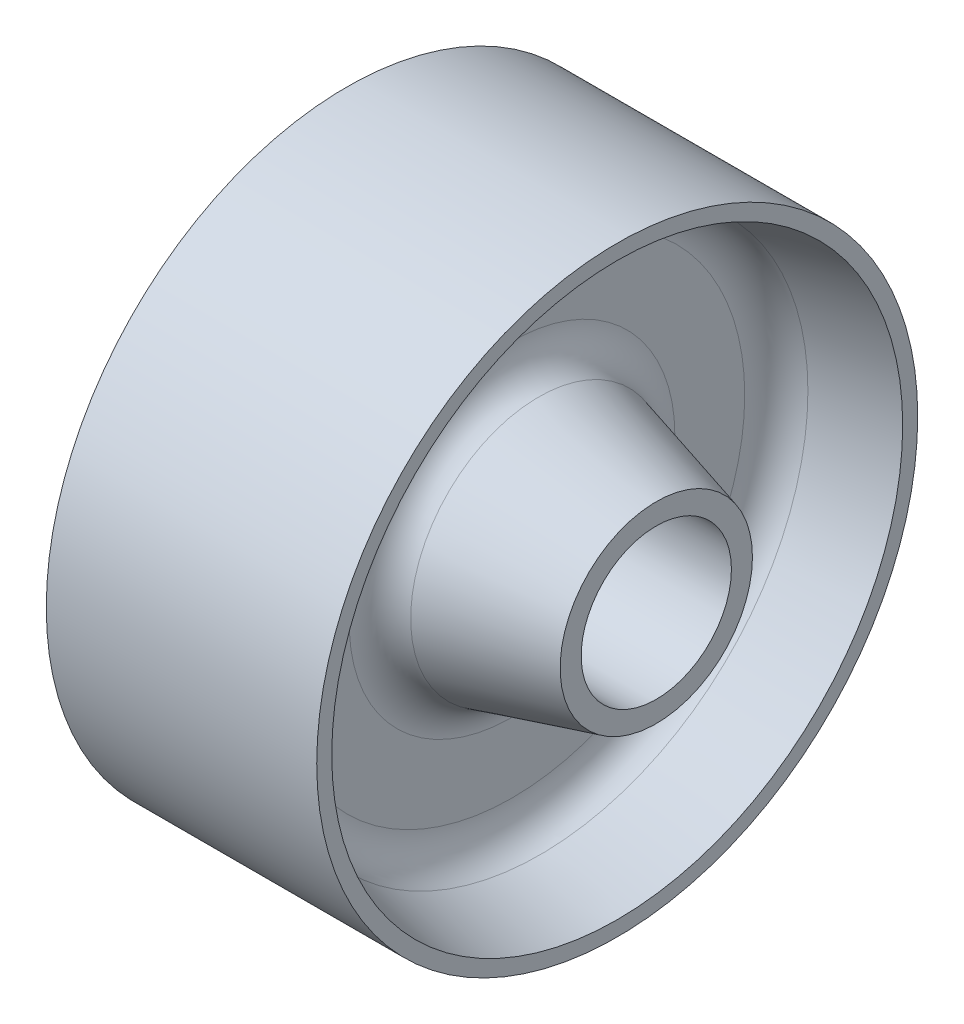
ISO-10303-21;
HEADER;
FILE_DESCRIPTION(('STEP AP214'),'2;1');
FILE_NAME('part.step','',(''),(''),'','','');
FILE_SCHEMA(('AUTOMOTIVE_DESIGN { 1 0 10303 214 1 1 1 1 }'));
ENDSEC;
DATA;
#1=APPLICATION_CONTEXT('core data for automotive mechanical design processes');
#2=APPLICATION_PROTOCOL_DEFINITION('international standard','automotive_design',2000,#1);
#3=PRODUCT_CONTEXT('',#1,'mechanical');
#4=PRODUCT('Part','Part','',(#3));
#5=PRODUCT_RELATED_PRODUCT_CATEGORY('part','',(#4));
#6=PRODUCT_DEFINITION_FORMATION('','',#4);
#7=PRODUCT_DEFINITION_CONTEXT('part definition',#1,'design');
#8=PRODUCT_DEFINITION('design','',#6,#7);
#9=PRODUCT_DEFINITION_SHAPE('','',#8);
#10=(LENGTH_UNIT() NAMED_UNIT(*) SI_UNIT(.MILLI.,.METRE.));
#11=(NAMED_UNIT(*) PLANE_ANGLE_UNIT() SI_UNIT($,.RADIAN.));
#12=(NAMED_UNIT(*) SI_UNIT($,.STERADIAN.) SOLID_ANGLE_UNIT());
#13=UNCERTAINTY_MEASURE_WITH_UNIT(LENGTH_MEASURE(1.E-05),#10,'distance_accuracy_value','');
#14=(GEOMETRIC_REPRESENTATION_CONTEXT(3) GLOBAL_UNCERTAINTY_ASSIGNED_CONTEXT((#13)) GLOBAL_UNIT_ASSIGNED_CONTEXT((#10,
#11,#12)) REPRESENTATION_CONTEXT('',''));
#15=CARTESIAN_POINT('',(0.,0.,0.));
#16=DIRECTION('',(0.,0.,1.));
#17=DIRECTION('',(1.,0.,0.));
#18=AXIS2_PLACEMENT_3D('',#15,#16,#17);
#19=CARTESIAN_POINT('',(11.,0.,0.));
#20=DIRECTION('',(1.,0.,0.));
#21=DIRECTION('',(0.,0.,-1.));
#22=AXIS2_PLACEMENT_3D('',#19,#20,#21);
#23=TOROIDAL_SURFACE('',#22,38.7166892327944,6.);
#24=CARTESIAN_POINT('',(4.99999999999999,0.,0.));
#25=DIRECTION('',(1.,0.,0.));
#26=DIRECTION('',(0.,0.,-1.));
#27=AXIS2_PLACEMENT_3D('',#24,#25,#26);
#28=CIRCLE('',#27,38.7166892327944);
#29=CARTESIAN_POINT('',(4.99999999999999,0.,-38.7166892327944));
#30=VERTEX_POINT('',#29);
#31=EDGE_CURVE('E85',#30,#30,#28,.T.);
#32=ORIENTED_EDGE('',*,*,#31,.F.);
#33=EDGE_LOOP('',(#32));
#34=FACE_BOUND('',#33,.T.);
#35=CARTESIAN_POINT('',(9.66305119098715,0.,0.));
#36=DIRECTION('',(1.,0.,0.));
#37=DIRECTION('',(0.,0.,-1.));
#38=AXIS2_PLACEMENT_3D('',#35,#36,#37);
#39=CIRCLE('',#38,44.5658402722256);
#40=CARTESIAN_POINT('',(9.66305119098715,0.,-44.5658402722256));
#41=VERTEX_POINT('',#40);
#42=EDGE_CURVE('E11',#41,#41,#39,.T.);
#43=ORIENTED_EDGE('',*,*,#42,.T.);
#44=EDGE_LOOP('',(#43));
#45=FACE_BOUND('',#44,.T.);
#46=ADVANCED_FACE('F39',(#34,#45),#23,.F.);
#47=CARTESIAN_POINT('',(9.66305119098715,0.,0.));
#48=DIRECTION('',(1.,0.,0.));
#49=DIRECTION('',(0.,0.,-1.));
#50=AXIS2_PLACEMENT_3D('',#47,#48,#49);
#51=CONICAL_SURFACE('',#50,44.5658402722256,0.224711168414643);
#52=CARTESIAN_POINT('',(22.5,0.,0.));
#53=DIRECTION('',(1.,0.,0.));
#54=DIRECTION('',(0.,0.,-1.));
#55=AXIS2_PLACEMENT_3D('',#52,#53,#54);
#56=CIRCLE('',#55,47.5);
#57=CARTESIAN_POINT('',(22.5,0.,-47.5));
#58=VERTEX_POINT('',#57);
#59=EDGE_CURVE('E45',#58,#58,#56,.T.);
#60=ORIENTED_EDGE('',*,*,#59,.T.);
#61=EDGE_LOOP('',(#60));
#62=FACE_BOUND('',#61,.T.);
#63=ORIENTED_EDGE('',*,*,#42,.F.);
#64=EDGE_LOOP('',(#63));
#65=FACE_BOUND('',#64,.T.);
#66=ADVANCED_FACE('F122',(#62,#65),#51,.F.);
#67=CARTESIAN_POINT('',(22.5,0.,0.));
#68=DIRECTION('',(1.,0.,0.));
#69=DIRECTION('',(0.,0.,-1.));
#70=AXIS2_PLACEMENT_3D('',#67,#68,#69);
#71=PLANE('',#70);
#72=CARTESIAN_POINT('',(22.5,0.,0.));
#73=DIRECTION('',(1.,0.,0.));
#74=DIRECTION('',(0.,0.,-1.));
#75=AXIS2_PLACEMENT_3D('',#72,#73,#74);
#76=CIRCLE('',#75,50.);
#77=CARTESIAN_POINT('',(22.5,0.,-50.));
#78=VERTEX_POINT('',#77);
#79=EDGE_CURVE('E49',#78,#78,#76,.T.);
#80=ORIENTED_EDGE('',*,*,#79,.T.);
#81=EDGE_LOOP('',(#80));
#82=FACE_BOUND('',#81,.T.);
#83=ORIENTED_EDGE('',*,*,#59,.F.);
#84=EDGE_LOOP('',(#83));
#85=FACE_BOUND('',#84,.T.);
#86=ADVANCED_FACE('F127',(#82,#85),#71,.T.);
#87=CARTESIAN_POINT('',(29.,0.,0.));
#88=DIRECTION('',(1.,0.,0.));
#89=DIRECTION('',(0.,0.,-1.));
#90=AXIS2_PLACEMENT_3D('',#87,#88,#89);
#91=CYLINDRICAL_SURFACE('',#90,50.);
#92=ORIENTED_EDGE('',*,*,#79,.F.);
#93=EDGE_LOOP('',(#92));
#94=FACE_BOUND('',#93,.T.);
#95=CARTESIAN_POINT('',(-22.5,0.,0.));
#96=DIRECTION('',(1.,0.,0.));
#97=DIRECTION('',(0.,0.,-1.));
#98=AXIS2_PLACEMENT_3D('',#95,#96,#97);
#99=CIRCLE('',#98,50.);
#100=CARTESIAN_POINT('',(-22.5,0.,-50.));
#101=VERTEX_POINT('',#100);
#102=EDGE_CURVE('E53',#101,#101,#99,.T.);
#103=ORIENTED_EDGE('',*,*,#102,.T.);
#104=EDGE_LOOP('',(#103));
#105=FACE_BOUND('',#104,.T.);
#106=ADVANCED_FACE('F207',(#94,#105),#91,.T.);
#107=CARTESIAN_POINT('',(-22.5,0.,0.));
#108=DIRECTION('',(1.,0.,0.));
#109=DIRECTION('',(0.,0.,-1.));
#110=AXIS2_PLACEMENT_3D('',#107,#108,#109);
#111=PLANE('',#110);
#112=ORIENTED_EDGE('',*,*,#102,.F.);
#113=EDGE_LOOP('',(#112));
#114=FACE_BOUND('',#113,.T.);
#115=CARTESIAN_POINT('',(-22.5,0.,0.));
#116=DIRECTION('',(1.,0.,0.));
#117=DIRECTION('',(0.,0.,-1.));
#118=AXIS2_PLACEMENT_3D('',#115,#116,#117);
#119=CIRCLE('',#118,47.5);
#120=CARTESIAN_POINT('',(-22.5,0.,-47.5));
#121=VERTEX_POINT('',#120);
#122=EDGE_CURVE('E58',#121,#121,#119,.T.);
#123=ORIENTED_EDGE('',*,*,#122,.T.);
#124=EDGE_LOOP('',(#123));
#125=FACE_BOUND('',#124,.T.);
#126=ADVANCED_FACE('F199',(#114,#125),#111,.F.);
#127=CARTESIAN_POINT('',(-9.66305119098715,0.,0.));
#128=DIRECTION('',(-1.,0.,0.));
#129=DIRECTION('',(0.,0.,1.));
#130=AXIS2_PLACEMENT_3D('',#127,#128,#129);
#131=CONICAL_SURFACE('',#130,44.5658402722256,0.224711168414644);
#132=ORIENTED_EDGE('',*,*,#122,.F.);
#133=EDGE_LOOP('',(#132));
#134=FACE_BOUND('',#133,.T.);
#135=CARTESIAN_POINT('',(-9.66305119098715,0.,0.));
#136=DIRECTION('',(1.,0.,0.));
#137=DIRECTION('',(0.,0.,-1.));
#138=AXIS2_PLACEMENT_3D('',#135,#136,#137);
#139=CIRCLE('',#138,44.5658402722256);
#140=CARTESIAN_POINT('',(-9.66305119098715,0.,-44.5658402722256));
#141=VERTEX_POINT('',#140);
#142=EDGE_CURVE('E61',#141,#141,#139,.T.);
#143=ORIENTED_EDGE('',*,*,#142,.T.);
#144=EDGE_LOOP('',(#143));
#145=FACE_BOUND('',#144,.T.);
#146=ADVANCED_FACE('F191',(#134,#145),#131,.F.);
#147=CARTESIAN_POINT('',(-11.,0.,0.));
#148=DIRECTION('',(1.,0.,0.));
#149=DIRECTION('',(0.,0.,-1.));
#150=AXIS2_PLACEMENT_3D('',#147,#148,#149);
#151=TOROIDAL_SURFACE('',#150,38.7166892327944,6.);
#152=ORIENTED_EDGE('',*,*,#142,.F.);
#153=EDGE_LOOP('',(#152));
#154=FACE_BOUND('',#153,.T.);
#155=CARTESIAN_POINT('',(-5.,0.,0.));
#156=DIRECTION('',(1.,0.,0.));
#157=DIRECTION('',(0.,0.,-1.));
#158=AXIS2_PLACEMENT_3D('',#155,#156,#157);
#159=CIRCLE('',#158,38.7166892327944);
#160=CARTESIAN_POINT('',(-5.,0.,-38.7166892327944));
#161=VERTEX_POINT('',#160);
#162=EDGE_CURVE('E64',#161,#161,#159,.T.);
#163=ORIENTED_EDGE('',*,*,#162,.T.);
#164=EDGE_LOOP('',(#163));
#165=FACE_BOUND('',#164,.T.);
#166=ADVANCED_FACE('F183',(#154,#165),#151,.F.);
#167=CARTESIAN_POINT('',(-5.,0.,0.));
#168=DIRECTION('',(1.,0.,0.));
#169=DIRECTION('',(0.,0.,-1.));
#170=AXIS2_PLACEMENT_3D('',#167,#168,#169);
#171=PLANE('',#170);
#172=ORIENTED_EDGE('',*,*,#162,.F.);
#173=EDGE_LOOP('',(#172));
#174=FACE_BOUND('',#173,.T.);
#175=CARTESIAN_POINT('',(-5.,0.,0.));
#176=DIRECTION('',(1.,0.,0.));
#177=DIRECTION('',(0.,0.,-1.));
#178=AXIS2_PLACEMENT_3D('',#175,#176,#177);
#179=CIRCLE('',#178,27.0911583795782);
#180=CARTESIAN_POINT('',(-5.,0.,-27.0911583795782));
#181=VERTEX_POINT('',#180);
#182=EDGE_CURVE('E67',#181,#181,#179,.T.);
#183=ORIENTED_EDGE('',*,*,#182,.T.);
#184=EDGE_LOOP('',(#183));
#185=FACE_BOUND('',#184,.T.);
#186=ADVANCED_FACE('F175',(#174,#185),#171,.F.);
#187=CARTESIAN_POINT('',(-11.,0.,0.));
#188=DIRECTION('',(1.,0.,0.));
#189=DIRECTION('',(0.,0.,-1.));
#190=AXIS2_PLACEMENT_3D('',#187,#188,#189);
#191=TOROIDAL_SURFACE('',#190,27.0911583795782,5.99999999999999);
#192=ORIENTED_EDGE('',*,*,#182,.F.);
#193=EDGE_LOOP('',(#192));
#194=FACE_BOUND('',#193,.T.);
#195=CARTESIAN_POINT('',(-9.43150714563009,0.,0.));
#196=DIRECTION('',(1.,0.,0.));
#197=DIRECTION('',(0.,0.,-1.));
#198=AXIS2_PLACEMENT_3D('',#195,#196,#197);
#199=CIRCLE('',#198,21.2998001480585);
#200=CARTESIAN_POINT('',(-9.43150714563009,0.,-21.2998001480585));
#201=VERTEX_POINT('',#200);
#202=EDGE_CURVE('E70',#201,#201,#199,.T.);
#203=ORIENTED_EDGE('',*,*,#202,.T.);
#204=EDGE_LOOP('',(#203));
#205=FACE_BOUND('',#204,.T.);
#206=ADVANCED_FACE('F168',(#194,#205),#191,.F.);
#207=CARTESIAN_POINT('',(-29.,0.,0.));
#208=DIRECTION('',(1.,0.,0.));
#209=DIRECTION('',(0.,0.,-1.));
#210=AXIS2_PLACEMENT_3D('',#207,#208,#209);
#211=CONICAL_SURFACE('',#210,16.,0.264488382549233);
#212=ORIENTED_EDGE('',*,*,#202,.F.);
#213=EDGE_LOOP('',(#212));
#214=FACE_BOUND('',#213,.T.);
#215=CARTESIAN_POINT('',(-29.,0.,0.));
#216=DIRECTION('',(1.,0.,0.));
#217=DIRECTION('',(0.,0.,-1.));
#218=AXIS2_PLACEMENT_3D('',#215,#216,#217);
#219=CIRCLE('',#218,16.);
#220=CARTESIAN_POINT('',(-29.,0.,-16.));
#221=VERTEX_POINT('',#220);
#222=EDGE_CURVE('E73',#221,#221,#219,.T.);
#223=ORIENTED_EDGE('',*,*,#222,.T.);
#224=EDGE_LOOP('',(#223));
#225=FACE_BOUND('',#224,.T.);
#226=ADVANCED_FACE('F158',(#214,#225),#211,.T.);
#227=CARTESIAN_POINT('',(-29.,0.,0.));
#228=DIRECTION('',(1.,0.,0.));
#229=DIRECTION('',(0.,0.,-1.));
#230=AXIS2_PLACEMENT_3D('',#227,#228,#229);
#231=PLANE('',#230);
#232=CARTESIAN_POINT('',(-29.,0.,0.));
#233=DIRECTION('',(1.,0.,0.));
#234=DIRECTION('',(0.,0.,-1.));
#235=AXIS2_PLACEMENT_3D('',#232,#233,#234);
#236=CIRCLE('',#235,12.5);
#237=CARTESIAN_POINT('',(-29.,0.,-12.5));
#238=VERTEX_POINT('',#237);
#239=EDGE_CURVE('E91',#238,#238,#236,.T.);
#240=ORIENTED_EDGE('',*,*,#239,.T.);
#241=EDGE_LOOP('',(#240));
#242=FACE_BOUND('',#241,.T.);
#243=ORIENTED_EDGE('',*,*,#222,.F.);
#244=EDGE_LOOP('',(#243));
#245=FACE_BOUND('',#244,.T.);
#246=ADVANCED_FACE('F95',(#242,#245),#231,.F.);
#247=CARTESIAN_POINT('',(29.,0.,0.));
#248=DIRECTION('',(1.,0.,0.));
#249=DIRECTION('',(0.,0.,-1.));
#250=AXIS2_PLACEMENT_3D('',#247,#248,#249);
#251=PLANE('',#250);
#252=CARTESIAN_POINT('',(29.,0.,0.));
#253=DIRECTION('',(1.,0.,0.));
#254=DIRECTION('',(0.,0.,-1.));
#255=AXIS2_PLACEMENT_3D('',#252,#253,#254);
#256=CIRCLE('',#255,12.5);
#257=CARTESIAN_POINT('',(29.,0.,-12.5));
#258=VERTEX_POINT('',#257);
#259=EDGE_CURVE('E88',#258,#258,#256,.T.);
#260=ORIENTED_EDGE('',*,*,#259,.F.);
#261=EDGE_LOOP('',(#260));
#262=FACE_BOUND('',#261,.T.);
#263=CARTESIAN_POINT('',(29.,0.,0.));
#264=DIRECTION('',(1.,0.,0.));
#265=DIRECTION('',(0.,0.,-1.));
#266=AXIS2_PLACEMENT_3D('',#263,#264,#265);
#267=CIRCLE('',#266,16.);
#268=CARTESIAN_POINT('',(29.,0.,-16.));
#269=VERTEX_POINT('',#268);
#270=EDGE_CURVE('E76',#269,#269,#267,.T.);
#271=ORIENTED_EDGE('',*,*,#270,.T.);
#272=EDGE_LOOP('',(#271));
#273=FACE_BOUND('',#272,.T.);
#274=ADVANCED_FACE('F105',(#262,#273),#251,.T.);
#275=CARTESIAN_POINT('',(29.,0.,0.));
#276=DIRECTION('',(-1.,0.,0.));
#277=DIRECTION('',(0.,0.,1.));
#278=AXIS2_PLACEMENT_3D('',#275,#276,#277);
#279=CONICAL_SURFACE('',#278,16.,0.264488382549233);
#280=CARTESIAN_POINT('',(9.43150714563008,0.,0.));
#281=DIRECTION('',(1.,0.,0.));
#282=DIRECTION('',(0.,0.,-1.));
#283=AXIS2_PLACEMENT_3D('',#280,#281,#282);
#284=CIRCLE('',#283,21.2998001480585);
#285=CARTESIAN_POINT('',(9.43150714563008,0.,-21.2998001480585));
#286=VERTEX_POINT('',#285);
#287=EDGE_CURVE('E79',#286,#286,#284,.T.);
#288=ORIENTED_EDGE('',*,*,#287,.T.);
#289=EDGE_LOOP('',(#288));
#290=FACE_BOUND('',#289,.T.);
#291=ORIENTED_EDGE('',*,*,#270,.F.);
#292=EDGE_LOOP('',(#291));
#293=FACE_BOUND('',#292,.T.);
#294=ADVANCED_FACE('F108',(#290,#293),#279,.T.);
#295=CARTESIAN_POINT('',(11.,0.,0.));
#296=DIRECTION('',(1.,0.,0.));
#297=DIRECTION('',(0.,0.,-1.));
#298=AXIS2_PLACEMENT_3D('',#295,#296,#297);
#299=TOROIDAL_SURFACE('',#298,27.0911583795782,5.99999999999999);
#300=ORIENTED_EDGE('',*,*,#287,.F.);
#301=EDGE_LOOP('',(#300));
#302=FACE_BOUND('',#301,.T.);
#303=CARTESIAN_POINT('',(4.99999999999999,0.,0.));
#304=DIRECTION('',(1.,0.,0.));
#305=DIRECTION('',(0.,0.,-1.));
#306=AXIS2_PLACEMENT_3D('',#303,#304,#305);
#307=CIRCLE('',#306,27.0911583795782);
#308=CARTESIAN_POINT('',(4.99999999999999,0.,-27.0911583795782));
#309=VERTEX_POINT('',#308);
#310=EDGE_CURVE('E82',#309,#309,#307,.T.);
#311=ORIENTED_EDGE('',*,*,#310,.T.);
#312=EDGE_LOOP('',(#311));
#313=FACE_BOUND('',#312,.T.);
#314=ADVANCED_FACE('F113',(#302,#313),#299,.F.);
#315=CARTESIAN_POINT('',(4.99999999999999,0.,0.));
#316=DIRECTION('',(1.,0.,0.));
#317=DIRECTION('',(0.,0.,-1.));
#318=AXIS2_PLACEMENT_3D('',#315,#316,#317);
#319=PLANE('',#318);
#320=ORIENTED_EDGE('',*,*,#31,.T.);
#321=EDGE_LOOP('',(#320));
#322=FACE_BOUND('',#321,.T.);
#323=ORIENTED_EDGE('',*,*,#310,.F.);
#324=EDGE_LOOP('',(#323));
#325=FACE_BOUND('',#324,.T.);
#326=ADVANCED_FACE('F101',(#322,#325),#319,.T.);
#327=CARTESIAN_POINT('',(-29.,0.,0.));
#328=DIRECTION('',(1.,0.,0.));
#329=DIRECTION('',(0.,0.,-1.));
#330=AXIS2_PLACEMENT_3D('',#327,#328,#329);
#331=CYLINDRICAL_SURFACE('',#330,12.5);
#332=CARTESIAN_POINT('',(-29.,0.,-12.5));
#333=CARTESIAN_POINT('',(-28.3958333333333,0.,-12.5));
#334=CARTESIAN_POINT('',(-27.7916666666667,0.,-12.5));
#335=CARTESIAN_POINT('',(-26.5833333333333,0.,-12.5));
#336=CARTESIAN_POINT('',(-25.9791666666667,0.,-12.5));
#337=CARTESIAN_POINT('',(-24.7708333333333,0.,-12.5));
#338=CARTESIAN_POINT('',(-24.1666666666667,0.,-12.5));
#339=CARTESIAN_POINT('',(-22.9583333333333,0.,-12.5));
#340=CARTESIAN_POINT('',(-22.3541666666667,0.,-12.5));
#341=CARTESIAN_POINT('',(-21.1458333333333,0.,-12.5));
#342=CARTESIAN_POINT('',(-20.5416666666667,0.,-12.5));
#343=CARTESIAN_POINT('',(-19.3333333333333,0.,-12.5));
#344=CARTESIAN_POINT('',(-18.7291666666667,0.,-12.5));
#345=CARTESIAN_POINT('',(-17.5208333333333,0.,-12.5));
#346=CARTESIAN_POINT('',(-16.9166666666667,0.,-12.5));
#347=CARTESIAN_POINT('',(-15.7083333333333,0.,-12.5));
#348=CARTESIAN_POINT('',(-15.1041666666667,0.,-12.5));
#349=CARTESIAN_POINT('',(-13.8958333333333,0.,-12.5));
#350=CARTESIAN_POINT('',(-13.2916666666667,0.,-12.5));
#351=CARTESIAN_POINT('',(-12.0833333333333,0.,-12.5));
#352=CARTESIAN_POINT('',(-11.4791666666667,0.,-12.5));
#353=CARTESIAN_POINT('',(-10.2708333333333,0.,-12.5));
#354=CARTESIAN_POINT('',(-9.66666666666666,0.,-12.5));
#355=CARTESIAN_POINT('',(-8.45833333333333,0.,-12.5));
#356=CARTESIAN_POINT('',(-7.85416666666666,0.,-12.5));
#357=CARTESIAN_POINT('',(-6.64583333333333,0.,-12.5));
#358=CARTESIAN_POINT('',(-6.04166666666666,0.,-12.5));
#359=CARTESIAN_POINT('',(-4.83333333333333,0.,-12.5));
#360=CARTESIAN_POINT('',(-4.22916666666666,0.,-12.5));
#361=CARTESIAN_POINT('',(-3.02083333333333,0.,-12.5));
#362=CARTESIAN_POINT('',(-2.41666666666666,0.,-12.5));
#363=CARTESIAN_POINT('',(-1.20833333333333,0.,-12.5));
#364=CARTESIAN_POINT('',(-0.60416666666666,0.,-12.5));
#365=CARTESIAN_POINT('',(0.604166666666674,0.,-12.5));
#366=CARTESIAN_POINT('',(1.20833333333334,0.,-12.5));
#367=CARTESIAN_POINT('',(2.41666666666667,0.,-12.5));
#368=CARTESIAN_POINT('',(3.02083333333334,0.,-12.5));
#369=CARTESIAN_POINT('',(4.22916666666667,0.,-12.5));
#370=CARTESIAN_POINT('',(4.83333333333334,0.,-12.5));
#371=CARTESIAN_POINT('',(6.04166666666667,0.,-12.5));
#372=CARTESIAN_POINT('',(6.64583333333333,0.,-12.5));
#373=CARTESIAN_POINT('',(7.85416666666667,0.,-12.5));
#374=CARTESIAN_POINT('',(8.45833333333334,0.,-12.5));
#375=CARTESIAN_POINT('',(9.66666666666667,0.,-12.5));
#376=CARTESIAN_POINT('',(10.2708333333333,0.,-12.5));
#377=CARTESIAN_POINT('',(11.4791666666667,0.,-12.5));
#378=CARTESIAN_POINT('',(12.0833333333333,0.,-12.5));
#379=CARTESIAN_POINT('',(13.2916666666667,0.,-12.5));
#380=CARTESIAN_POINT('',(13.8958333333333,0.,-12.5));
#381=CARTESIAN_POINT('',(15.1041666666667,0.,-12.5));
#382=CARTESIAN_POINT('',(15.7083333333333,0.,-12.5));
#383=CARTESIAN_POINT('',(16.9166666666667,0.,-12.5));
#384=CARTESIAN_POINT('',(17.5208333333333,0.,-12.5));
#385=CARTESIAN_POINT('',(18.7291666666667,0.,-12.5));
#386=CARTESIAN_POINT('',(19.3333333333333,0.,-12.5));
#387=CARTESIAN_POINT('',(20.5416666666667,0.,-12.5));
#388=CARTESIAN_POINT('',(21.1458333333333,0.,-12.5));
#389=CARTESIAN_POINT('',(22.3541666666667,0.,-12.5));
#390=CARTESIAN_POINT('',(22.9583333333333,0.,-12.5));
#391=CARTESIAN_POINT('',(24.1666666666667,0.,-12.5));
#392=CARTESIAN_POINT('',(24.7708333333333,0.,-12.5));
#393=CARTESIAN_POINT('',(25.9791666666667,0.,-12.5));
#394=CARTESIAN_POINT('',(26.5833333333333,0.,-12.5));
#395=CARTESIAN_POINT('',(27.7916666666667,0.,-12.5));
#396=CARTESIAN_POINT('',(28.3958333333333,0.,-12.5));
#397=CARTESIAN_POINT('',(29.,0.,-12.5));
#398=B_SPLINE_CURVE_WITH_KNOTS('',3,(#332,#333,#334,#335,#336,#337,#338,#339,#340,#341,#342,
#343,#344,#345,#346,#347,#348,#349,#350,#351,#352,#353,#354,#355,#356,#357,#358,#359,#360,#361,
#362,#363,#364,#365,#366,#367,#368,#369,#370,#371,#372,#373,#374,#375,#376,#377,#378,#379,#380,
#381,#382,#383,#384,#385,#386,#387,#388,#389,#390,#391,#392,#393,#394,#395,#396,#397),
.UNSPECIFIED.,.F.,.F.,(4,2,2,2,2,2,2,2,2,2,2,2,2,2,2,2,2,2,2,2,2,2,2,2,2,2,2,2,2,2,2,2,4),(0.,
1.8125,3.625,5.4375,7.25,9.0625,10.875,12.6875,14.5,16.3125,18.125,19.9375,21.75,23.5625,25.375,
27.1875,29.,30.8125,32.625,34.4375,36.25,38.0625,39.875,41.6875,43.5,45.3125,47.125,48.9375,
50.75,52.5625,54.375,56.1875,58.),.UNSPECIFIED.);
#399=EDGE_CURVE('BSEAM98',#238,#258,#398,.T.);
#400=ORIENTED_EDGE('',*,*,#239,.F.);
#401=ORIENTED_EDGE('',*,*,#259,.T.);
#402=ORIENTED_EDGE('',*,*,#399,.T.);
#403=ORIENTED_EDGE('',*,*,#399,.F.);
#404=EDGE_LOOP('',(#400,#402,#401,#403));
#405=FACE_BOUND('',#404,.T.);
#406=ADVANCED_FACE('F98',(#405),#331,.F.);
#407=CLOSED_SHELL('',(#46,#66,#86,#106,#126,#146,#166,#186,#206,#226,#246,#274,#294,#314,#326,#406));
#408=MANIFOLD_SOLID_BREP('B2',#407);
#409=ADVANCED_BREP_SHAPE_REPRESENTATION('',(#18,#408),#14);
#410=SHAPE_DEFINITION_REPRESENTATION(#9,#409);
ENDSEC;
END-ISO-10303-21;
